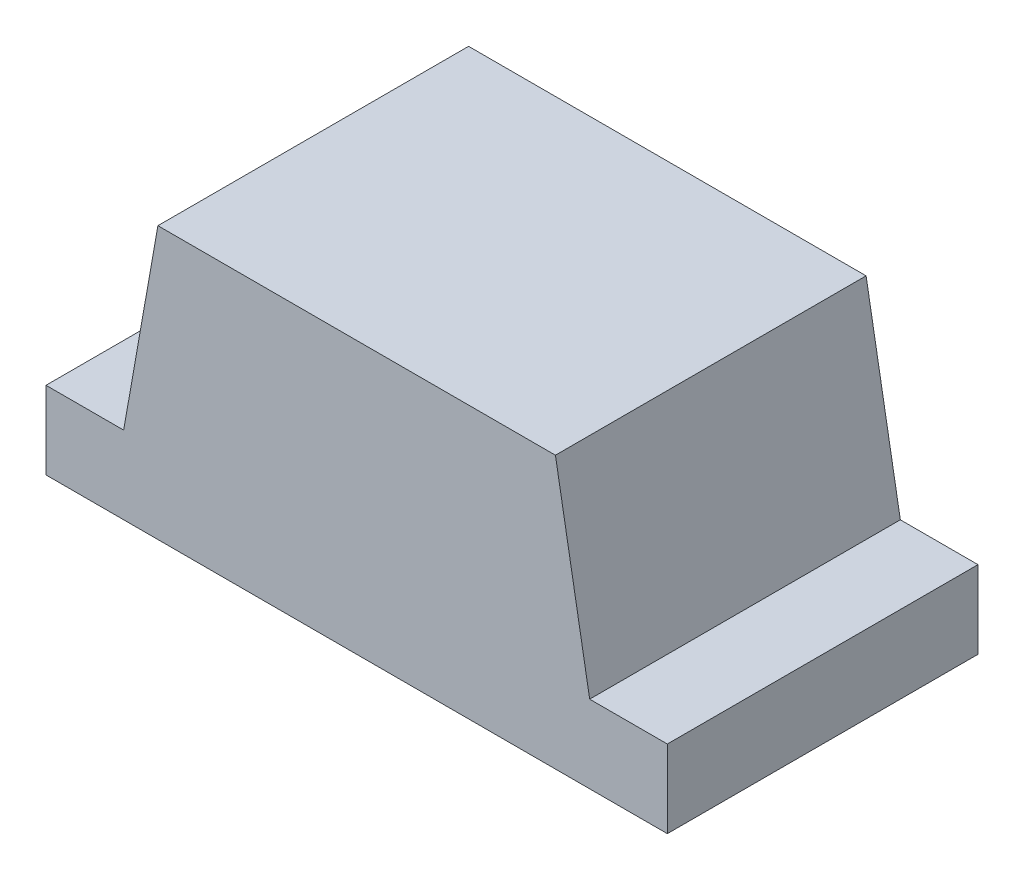
ISO-10303-21;
HEADER;
FILE_DESCRIPTION(('STEP AP214'),'2;1');
FILE_NAME('part.step','',(''),(''),'','','');
FILE_SCHEMA(('AUTOMOTIVE_DESIGN { 1 0 10303 214 1 1 1 1 }'));
ENDSEC;
DATA;
#1=APPLICATION_CONTEXT('core data for automotive mechanical design processes');
#2=APPLICATION_PROTOCOL_DEFINITION('international standard','automotive_design',2000,#1);
#3=PRODUCT_CONTEXT('',#1,'mechanical');
#4=PRODUCT('Part','Part','',(#3));
#5=PRODUCT_RELATED_PRODUCT_CATEGORY('part','',(#4));
#6=PRODUCT_DEFINITION_FORMATION('','',#4);
#7=PRODUCT_DEFINITION_CONTEXT('part definition',#1,'design');
#8=PRODUCT_DEFINITION('design','',#6,#7);
#9=PRODUCT_DEFINITION_SHAPE('','',#8);
#10=(LENGTH_UNIT() NAMED_UNIT(*) SI_UNIT(.MILLI.,.METRE.));
#11=(NAMED_UNIT(*) PLANE_ANGLE_UNIT() SI_UNIT($,.RADIAN.));
#12=(NAMED_UNIT(*) SI_UNIT($,.STERADIAN.) SOLID_ANGLE_UNIT());
#13=UNCERTAINTY_MEASURE_WITH_UNIT(LENGTH_MEASURE(1.E-05),#10,'distance_accuracy_value','');
#14=(GEOMETRIC_REPRESENTATION_CONTEXT(3) GLOBAL_UNCERTAINTY_ASSIGNED_CONTEXT((#13)) GLOBAL_UNIT_ASSIGNED_CONTEXT((#10,
#11,#12)) REPRESENTATION_CONTEXT('',''));
#15=CARTESIAN_POINT('',(0.,0.,0.));
#16=DIRECTION('',(0.,0.,1.));
#17=DIRECTION('',(1.,0.,0.));
#18=AXIS2_PLACEMENT_3D('',#15,#16,#17);
#19=CARTESIAN_POINT('',(-0.8,0.,-0.4));
#20=DIRECTION('',(0.,0.,1.));
#21=DIRECTION('',(1.,0.,0.));
#22=AXIS2_PLACEMENT_3D('',#19,#20,#21);
#23=PLANE('',#22);
#24=DIRECTION('',(0.,1.,0.));
#25=VECTOR('',#24,1.);
#26=CARTESIAN_POINT('',(-0.8,0.1,-0.4));
#27=LINE('',#26,#25);
#28=CARTESIAN_POINT('',(-0.8,0.,-0.4));
#29=VERTEX_POINT('',#28);
#30=CARTESIAN_POINT('',(-0.8,0.20000000005,-0.4));
#31=VERTEX_POINT('',#30);
#32=EDGE_CURVE('E84',#29,#31,#27,.T.);
#33=ORIENTED_EDGE('',*,*,#32,.T.);
#34=DIRECTION('',(1.,0.,0.));
#35=VECTOR('',#34,1.);
#36=CARTESIAN_POINT('',(-0.7,0.2,-0.4));
#37=LINE('',#36,#35);
#38=CARTESIAN_POINT('',(-0.6,0.20000000005,-0.4));
#39=VERTEX_POINT('',#38);
#40=EDGE_CURVE('E105',#31,#39,#37,.T.);
#41=ORIENTED_EDGE('',*,*,#40,.T.);
#42=DIRECTION('',(-0.173648176990267,-0.984807753131522,0.));
#43=VECTOR('',#42,1.);
#44=CARTESIAN_POINT('',(-0.555918255,0.45,-0.4));
#45=LINE('',#44,#43);
#46=CARTESIAN_POINT('',(-0.5118365101,0.7,-0.4));
#47=VERTEX_POINT('',#46);
#48=EDGE_CURVE('E104',#47,#39,#45,.T.);
#49=ORIENTED_EDGE('',*,*,#48,.F.);
#50=DIRECTION('',(1.,0.,0.));
#51=VECTOR('',#50,1.);
#52=CARTESIAN_POINT('',(0.,0.7,-0.4));
#53=LINE('',#52,#51);
#54=CARTESIAN_POINT('',(0.51183651,0.7,-0.4));
#55=VERTEX_POINT('',#54);
#56=EDGE_CURVE('E82',#47,#55,#53,.T.);
#57=ORIENTED_EDGE('',*,*,#56,.T.);
#58=DIRECTION('',(-0.173648176990267,0.984807753131522,0.));
#59=VECTOR('',#58,1.);
#60=CARTESIAN_POINT('',(0.6,0.2,-0.4));
#61=LINE('',#60,#59);
#62=CARTESIAN_POINT('',(0.599999999982367,0.2000000001,-0.4));
#63=VERTEX_POINT('',#62);
#64=EDGE_CURVE('E20',#63,#55,#61,.T.);
#65=ORIENTED_EDGE('',*,*,#64,.F.);
#66=DIRECTION('',(-1.,0.,0.));
#67=VECTOR('',#66,1.);
#68=CARTESIAN_POINT('',(0.,0.2000000002,-0.4));
#69=LINE('',#68,#67);
#70=CARTESIAN_POINT('',(0.8,0.2000000001,-0.4));
#71=VERTEX_POINT('',#70);
#72=EDGE_CURVE('E79',#71,#63,#69,.T.);
#73=ORIENTED_EDGE('',*,*,#72,.F.);
#74=DIRECTION('',(0.,1.,0.));
#75=VECTOR('',#74,1.);
#76=CARTESIAN_POINT('',(0.8,0.35,-0.4));
#77=LINE('',#76,#75);
#78=CARTESIAN_POINT('',(0.8,0.,-0.4));
#79=VERTEX_POINT('',#78);
#80=EDGE_CURVE('E92',#79,#71,#77,.T.);
#81=ORIENTED_EDGE('',*,*,#80,.F.);
#82=DIRECTION('',(1.,0.,0.));
#83=VECTOR('',#82,1.);
#84=CARTESIAN_POINT('',(0.,0.,-0.4));
#85=LINE('',#84,#83);
#86=EDGE_CURVE('E113',#29,#79,#85,.T.);
#87=ORIENTED_EDGE('',*,*,#86,.F.);
#88=EDGE_LOOP('',(#33,#41,#49,#57,#65,#73,#81,#87));
#89=FACE_BOUND('',#88,.T.);
#90=ADVANCED_FACE('F16',(#89),#23,.F.);
#91=CARTESIAN_POINT('',(-0.8,0.,0.4));
#92=DIRECTION('',(1.,0.,0.));
#93=DIRECTION('',(0.,0.,-1.));
#94=AXIS2_PLACEMENT_3D('',#91,#92,#93);
#95=PLANE('',#94);
#96=DIRECTION('',(0.,1.,0.));
#97=VECTOR('',#96,1.);
#98=CARTESIAN_POINT('',(-0.8,0.35,0.4));
#99=LINE('',#98,#97);
#100=CARTESIAN_POINT('',(-0.8,0.,0.4));
#101=VERTEX_POINT('',#100);
#102=CARTESIAN_POINT('',(-0.8,0.20000000005,0.4));
#103=VERTEX_POINT('',#102);
#104=EDGE_CURVE('E110',#101,#103,#99,.T.);
#105=ORIENTED_EDGE('',*,*,#104,.T.);
#106=DIRECTION('',(0.,0.,-1.));
#107=VECTOR('',#106,1.);
#108=CARTESIAN_POINT('',(-0.8,0.2,0.));
#109=LINE('',#108,#107);
#110=EDGE_CURVE('E132',#103,#31,#109,.T.);
#111=ORIENTED_EDGE('',*,*,#110,.T.);
#112=ORIENTED_EDGE('',*,*,#32,.F.);
#113=DIRECTION('',(0.,0.,-1.));
#114=VECTOR('',#113,1.);
#115=CARTESIAN_POINT('',(-0.8,0.,0.));
#116=LINE('',#115,#114);
#117=EDGE_CURVE('E139',#101,#29,#116,.T.);
#118=ORIENTED_EDGE('',*,*,#117,.F.);
#119=EDGE_LOOP('',(#105,#111,#112,#118));
#120=FACE_BOUND('',#119,.T.);
#121=ADVANCED_FACE('F160',(#120),#95,.F.);
#122=CARTESIAN_POINT('',(-0.8,0.2,0.4));
#123=DIRECTION('',(0.,-1.,0.));
#124=DIRECTION('',(0.,0.,-1.));
#125=AXIS2_PLACEMENT_3D('',#122,#123,#124);
#126=PLANE('',#125);
#127=ORIENTED_EDGE('',*,*,#40,.F.);
#128=ORIENTED_EDGE('',*,*,#110,.F.);
#129=DIRECTION('',(1.,0.,0.));
#130=VECTOR('',#129,1.);
#131=CARTESIAN_POINT('',(0.,0.2000000002,0.4));
#132=LINE('',#131,#130);
#133=CARTESIAN_POINT('',(-0.599999999982367,0.2000000001,0.4));
#134=VERTEX_POINT('',#133);
#135=EDGE_CURVE('E106',#103,#134,#132,.T.);
#136=ORIENTED_EDGE('',*,*,#135,.T.);
#137=DIRECTION('',(0.,0.,1.));
#138=VECTOR('',#137,1.);
#139=CARTESIAN_POINT('',(-0.6,0.2,0.));
#140=LINE('',#139,#138);
#141=EDGE_CURVE('E102',#39,#134,#140,.T.);
#142=ORIENTED_EDGE('',*,*,#141,.F.);
#143=EDGE_LOOP('',(#127,#128,#136,#142));
#144=FACE_BOUND('',#143,.T.);
#145=ADVANCED_FACE('F130',(#144),#126,.F.);
#146=CARTESIAN_POINT('',(-0.51183651,0.7,-0.4));
#147=DIRECTION('',(-0.984807753131522,0.173648176990267,0.));
#148=DIRECTION('',(-0.173648176990267,-0.984807753131522,0.));
#149=AXIS2_PLACEMENT_3D('',#146,#147,#148);
#150=PLANE('',#149);
#151=DIRECTION('',(0.,0.,-1.));
#152=VECTOR('',#151,1.);
#153=CARTESIAN_POINT('',(-0.51183651,0.7,0.));
#154=LINE('',#153,#152);
#155=CARTESIAN_POINT('',(-0.51183651,0.7,0.4));
#156=VERTEX_POINT('',#155);
#157=EDGE_CURVE('E98',#156,#47,#154,.T.);
#158=ORIENTED_EDGE('',*,*,#157,.T.);
#159=ORIENTED_EDGE('',*,*,#48,.T.);
#160=ORIENTED_EDGE('',*,*,#141,.T.);
#161=DIRECTION('',(-0.173648176990267,-0.984807753131522,0.));
#162=VECTOR('',#161,1.);
#163=CARTESIAN_POINT('',(-0.51183651,0.7,0.4));
#164=LINE('',#163,#162);
#165=EDGE_CURVE('E109',#134,#156,#164,.F.);
#166=ORIENTED_EDGE('',*,*,#165,.T.);
#167=EDGE_LOOP('',(#158,#159,#160,#166));
#168=FACE_BOUND('',#167,.T.);
#169=ADVANCED_FACE('F120',(#168),#150,.T.);
#170=CARTESIAN_POINT('',(-0.8,0.,0.4));
#171=DIRECTION('',(0.,-1.,0.));
#172=DIRECTION('',(0.,0.,-1.));
#173=AXIS2_PLACEMENT_3D('',#170,#171,#172);
#174=PLANE('',#173);
#175=ORIENTED_EDGE('',*,*,#117,.T.);
#176=ORIENTED_EDGE('',*,*,#86,.T.);
#177=DIRECTION('',(0.,0.,1.));
#178=VECTOR('',#177,1.);
#179=CARTESIAN_POINT('',(0.8,0.,0.));
#180=LINE('',#179,#178);
#181=CARTESIAN_POINT('',(0.8,0.,0.4));
#182=VERTEX_POINT('',#181);
#183=EDGE_CURVE('E97',#79,#182,#180,.T.);
#184=ORIENTED_EDGE('',*,*,#183,.T.);
#185=DIRECTION('',(-1.,0.,0.));
#186=VECTOR('',#185,1.);
#187=CARTESIAN_POINT('',(0.,0.,0.4));
#188=LINE('',#187,#186);
#189=EDGE_CURVE('E101',#182,#101,#188,.T.);
#190=ORIENTED_EDGE('',*,*,#189,.T.);
#191=EDGE_LOOP('',(#175,#176,#184,#190));
#192=FACE_BOUND('',#191,.T.);
#193=ADVANCED_FACE('F158',(#192),#174,.T.);
#194=CARTESIAN_POINT('',(-0.51183651,0.7,0.4));
#195=DIRECTION('',(0.,-1.,0.));
#196=DIRECTION('',(0.,0.,-1.));
#197=AXIS2_PLACEMENT_3D('',#194,#195,#196);
#198=PLANE('',#197);
#199=ORIENTED_EDGE('',*,*,#56,.F.);
#200=ORIENTED_EDGE('',*,*,#157,.F.);
#201=DIRECTION('',(1.,0.,0.));
#202=VECTOR('',#201,1.);
#203=CARTESIAN_POINT('',(0.,0.7,0.4));
#204=LINE('',#203,#202);
#205=CARTESIAN_POINT('',(0.5118365101,0.7,0.4));
#206=VERTEX_POINT('',#205);
#207=EDGE_CURVE('E114',#156,#206,#204,.T.);
#208=ORIENTED_EDGE('',*,*,#207,.T.);
#209=DIRECTION('',(0.,0.,1.));
#210=VECTOR('',#209,1.);
#211=CARTESIAN_POINT('',(0.51183651,0.7,0.));
#212=LINE('',#211,#210);
#213=EDGE_CURVE('E99',#55,#206,#212,.T.);
#214=ORIENTED_EDGE('',*,*,#213,.F.);
#215=EDGE_LOOP('',(#199,#200,#208,#214));
#216=FACE_BOUND('',#215,.T.);
#217=ADVANCED_FACE('F162',(#216),#198,.F.);
#218=CARTESIAN_POINT('',(0.8,0.,-0.4));
#219=DIRECTION('',(-1.,0.,0.));
#220=DIRECTION('',(0.,0.,1.));
#221=AXIS2_PLACEMENT_3D('',#218,#219,#220);
#222=PLANE('',#221);
#223=ORIENTED_EDGE('',*,*,#80,.T.);
#224=DIRECTION('',(0.,0.,1.));
#225=VECTOR('',#224,1.);
#226=CARTESIAN_POINT('',(0.8,0.2,0.));
#227=LINE('',#226,#225);
#228=CARTESIAN_POINT('',(0.8,0.20000000005,0.4));
#229=VERTEX_POINT('',#228);
#230=EDGE_CURVE('E90',#71,#229,#227,.T.);
#231=ORIENTED_EDGE('',*,*,#230,.T.);
#232=DIRECTION('',(0.,-1.,0.));
#233=VECTOR('',#232,1.);
#234=CARTESIAN_POINT('',(0.8,0.35,0.4));
#235=LINE('',#234,#233);
#236=EDGE_CURVE('E116',#229,#182,#235,.T.);
#237=ORIENTED_EDGE('',*,*,#236,.T.);
#238=ORIENTED_EDGE('',*,*,#183,.F.);
#239=EDGE_LOOP('',(#223,#231,#237,#238));
#240=FACE_BOUND('',#239,.T.);
#241=ADVANCED_FACE('F154',(#240),#222,.F.);
#242=CARTESIAN_POINT('',(0.8,0.,0.4));
#243=DIRECTION('',(0.,0.,-1.));
#244=DIRECTION('',(-1.,0.,0.));
#245=AXIS2_PLACEMENT_3D('',#242,#243,#244);
#246=PLANE('',#245);
#247=ORIENTED_EDGE('',*,*,#236,.F.);
#248=DIRECTION('',(-1.,0.,0.));
#249=VECTOR('',#248,1.);
#250=CARTESIAN_POINT('',(0.7,0.2,0.4));
#251=LINE('',#250,#249);
#252=CARTESIAN_POINT('',(0.6,0.2000000001,0.4));
#253=VERTEX_POINT('',#252);
#254=EDGE_CURVE('E26',#229,#253,#251,.T.);
#255=ORIENTED_EDGE('',*,*,#254,.T.);
#256=DIRECTION('',(0.173648176990267,-0.984807753131522,0.));
#257=VECTOR('',#256,1.);
#258=CARTESIAN_POINT('',(0.555918255,0.45,0.4));
#259=LINE('',#258,#257);
#260=EDGE_CURVE('E34',#206,#253,#259,.T.);
#261=ORIENTED_EDGE('',*,*,#260,.F.);
#262=ORIENTED_EDGE('',*,*,#207,.F.);
#263=ORIENTED_EDGE('',*,*,#165,.F.);
#264=ORIENTED_EDGE('',*,*,#135,.F.);
#265=ORIENTED_EDGE('',*,*,#104,.F.);
#266=ORIENTED_EDGE('',*,*,#189,.F.);
#267=EDGE_LOOP('',(#247,#255,#261,#262,#263,#264,#265,#266));
#268=FACE_BOUND('',#267,.T.);
#269=ADVANCED_FACE('F126',(#268),#246,.F.);
#270=CARTESIAN_POINT('',(0.6,0.2,-0.4));
#271=DIRECTION('',(0.984807753131522,0.173648176990267,0.));
#272=DIRECTION('',(-0.173648176990267,0.984807753131522,0.));
#273=AXIS2_PLACEMENT_3D('',#270,#271,#272);
#274=PLANE('',#273);
#275=ORIENTED_EDGE('',*,*,#213,.T.);
#276=ORIENTED_EDGE('',*,*,#260,.T.);
#277=DIRECTION('',(0.,0.,-1.));
#278=VECTOR('',#277,1.);
#279=CARTESIAN_POINT('',(0.6,0.2,0.));
#280=LINE('',#279,#278);
#281=EDGE_CURVE('E11',#253,#63,#280,.T.);
#282=ORIENTED_EDGE('',*,*,#281,.T.);
#283=ORIENTED_EDGE('',*,*,#64,.T.);
#284=EDGE_LOOP('',(#275,#276,#282,#283));
#285=FACE_BOUND('',#284,.T.);
#286=ADVANCED_FACE('F85',(#285),#274,.T.);
#287=CARTESIAN_POINT('',(0.6,0.2,0.4));
#288=DIRECTION('',(0.,-1.,0.));
#289=DIRECTION('',(0.,0.,-1.));
#290=AXIS2_PLACEMENT_3D('',#287,#288,#289);
#291=PLANE('',#290);
#292=ORIENTED_EDGE('',*,*,#254,.F.);
#293=ORIENTED_EDGE('',*,*,#230,.F.);
#294=ORIENTED_EDGE('',*,*,#72,.T.);
#295=ORIENTED_EDGE('',*,*,#281,.F.);
#296=EDGE_LOOP('',(#292,#293,#294,#295));
#297=FACE_BOUND('',#296,.T.);
#298=ADVANCED_FACE('F18',(#297),#291,.F.);
#299=CLOSED_SHELL('',(#90,#121,#145,#169,#193,#217,#241,#269,#286,#298));
#300=MANIFOLD_SOLID_BREP('B1',#299);
#301=ADVANCED_BREP_SHAPE_REPRESENTATION('',(#18,#300),#14);
#302=SHAPE_DEFINITION_REPRESENTATION(#9,#301);
ENDSEC;
END-ISO-10303-21;
